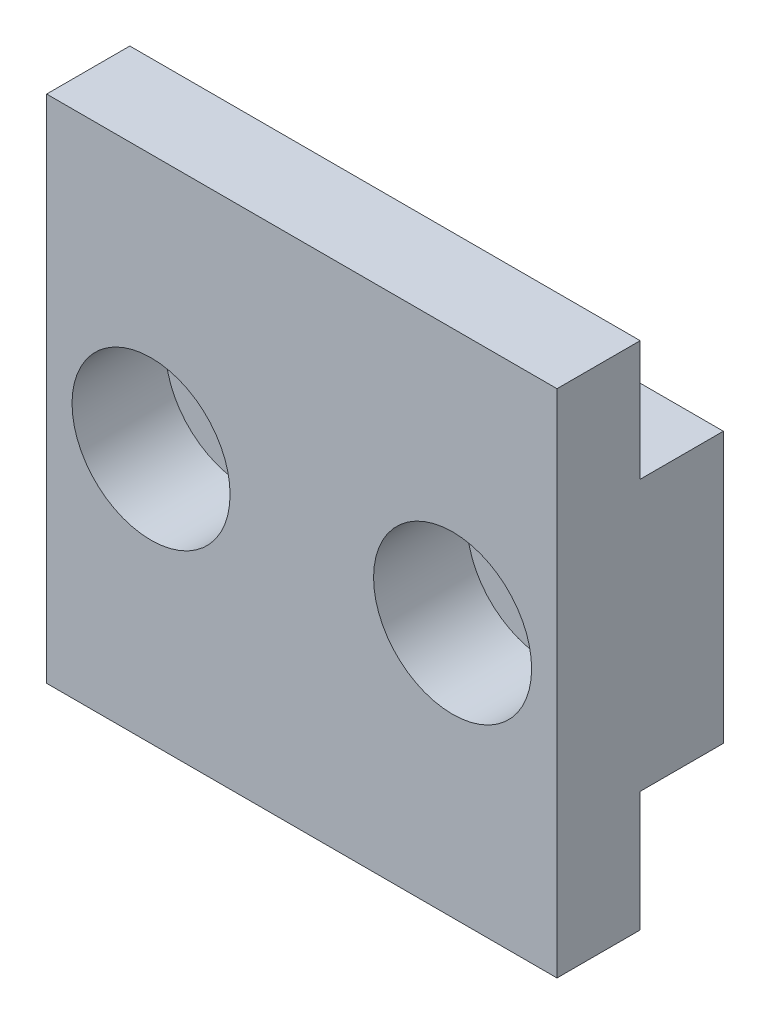
ISO-10303-21;
HEADER;
FILE_DESCRIPTION(('STEP AP214'),'2;1');
FILE_NAME('part.step','',(''),(''),'','','');
FILE_SCHEMA(('AUTOMOTIVE_DESIGN { 1 0 10303 214 1 1 1 1 }'));
ENDSEC;
DATA;
#1=APPLICATION_CONTEXT('core data for automotive mechanical design processes');
#2=APPLICATION_PROTOCOL_DEFINITION('international standard','automotive_design',2000,#1);
#3=PRODUCT_CONTEXT('',#1,'mechanical');
#4=PRODUCT('Part','Part','',(#3));
#5=PRODUCT_RELATED_PRODUCT_CATEGORY('part','',(#4));
#6=PRODUCT_DEFINITION_FORMATION('','',#4);
#7=PRODUCT_DEFINITION_CONTEXT('part definition',#1,'design');
#8=PRODUCT_DEFINITION('design','',#6,#7);
#9=PRODUCT_DEFINITION_SHAPE('','',#8);
#10=(LENGTH_UNIT() NAMED_UNIT(*) SI_UNIT(.MILLI.,.METRE.));
#11=(NAMED_UNIT(*) PLANE_ANGLE_UNIT() SI_UNIT($,.RADIAN.));
#12=(NAMED_UNIT(*) SI_UNIT($,.STERADIAN.) SOLID_ANGLE_UNIT());
#13=UNCERTAINTY_MEASURE_WITH_UNIT(LENGTH_MEASURE(1.E-05),#10,'distance_accuracy_value','');
#14=(GEOMETRIC_REPRESENTATION_CONTEXT(3) GLOBAL_UNCERTAINTY_ASSIGNED_CONTEXT((#13)) GLOBAL_UNIT_ASSIGNED_CONTEXT((#10,
#11,#12)) REPRESENTATION_CONTEXT('',''));
#15=CARTESIAN_POINT('',(0.,0.,0.));
#16=DIRECTION('',(0.,0.,1.));
#17=DIRECTION('',(1.,0.,0.));
#18=AXIS2_PLACEMENT_3D('',#15,#16,#17);
#19=CARTESIAN_POINT('',(74.979,6.5,8.));
#20=DIRECTION('',(0.,0.,-1.));
#21=DIRECTION('',(-1.,0.,0.));
#22=AXIS2_PLACEMENT_3D('',#19,#20,#21);
#23=CYLINDRICAL_SURFACE('',#22,2.29999999999999);
#24=CARTESIAN_POINT('',(74.979,6.5,0.));
#25=DIRECTION('',(0.,0.,-1.));
#26=DIRECTION('',(-1.,0.,0.));
#27=AXIS2_PLACEMENT_3D('',#24,#25,#26);
#28=CIRCLE('',#27,2.29999999999999);
#29=CARTESIAN_POINT('',(72.679,6.5,0.));
#30=VERTEX_POINT('',#29);
#31=EDGE_CURVE('E156',#30,#30,#28,.T.);
#32=ORIENTED_EDGE('',*,*,#31,.T.);
#33=EDGE_LOOP('',(#32));
#34=FACE_BOUND('',#33,.T.);
#35=CARTESIAN_POINT('',(74.979,6.5,3.5));
#36=DIRECTION('',(0.,0.,1.));
#37=DIRECTION('',(1.,0.,0.));
#38=AXIS2_PLACEMENT_3D('',#35,#36,#37);
#39=CIRCLE('',#38,2.29999999999999);
#40=CARTESIAN_POINT('',(77.279,6.5,3.5));
#41=VERTEX_POINT('',#40);
#42=EDGE_CURVE('E37',#41,#41,#39,.F.);
#43=ORIENTED_EDGE('',*,*,#42,.F.);
#44=EDGE_LOOP('',(#43));
#45=FACE_BOUND('',#44,.T.);
#46=ADVANCED_FACE('F33',(#34,#45),#23,.F.);
#47=CARTESIAN_POINT('',(60.479,6.5,8.));
#48=DIRECTION('',(0.,0.,-1.));
#49=DIRECTION('',(-1.,0.,0.));
#50=AXIS2_PLACEMENT_3D('',#47,#48,#49);
#51=CYLINDRICAL_SURFACE('',#50,2.3);
#52=CARTESIAN_POINT('',(60.479,6.5,0.));
#53=DIRECTION('',(0.,0.,-1.));
#54=DIRECTION('',(-1.,0.,0.));
#55=AXIS2_PLACEMENT_3D('',#52,#53,#54);
#56=CIRCLE('',#55,2.3);
#57=CARTESIAN_POINT('',(58.179,6.5,0.));
#58=VERTEX_POINT('',#57);
#59=EDGE_CURVE('E171',#58,#58,#56,.T.);
#60=ORIENTED_EDGE('',*,*,#59,.T.);
#61=EDGE_LOOP('',(#60));
#62=FACE_BOUND('',#61,.T.);
#63=CARTESIAN_POINT('',(60.479,6.5,3.5));
#64=DIRECTION('',(0.,0.,1.));
#65=DIRECTION('',(1.,0.,0.));
#66=AXIS2_PLACEMENT_3D('',#63,#64,#65);
#67=CIRCLE('',#66,2.3);
#68=CARTESIAN_POINT('',(62.779,6.5,3.5));
#69=VERTEX_POINT('',#68);
#70=EDGE_CURVE('E150',#69,#69,#67,.F.);
#71=ORIENTED_EDGE('',*,*,#70,.F.);
#72=EDGE_LOOP('',(#71));
#73=FACE_BOUND('',#72,.T.);
#74=ADVANCED_FACE('F216',(#62,#73),#51,.F.);
#75=CARTESIAN_POINT('',(80.,0.,4.));
#76=DIRECTION('',(-1.,0.,0.));
#77=DIRECTION('',(0.,0.,1.));
#78=AXIS2_PLACEMENT_3D('',#75,#76,#77);
#79=PLANE('',#78);
#80=DIRECTION('',(0.,1.,0.));
#81=VECTOR('',#80,1.);
#82=CARTESIAN_POINT('',(80.,0.,0.));
#83=LINE('',#82,#81);
#84=CARTESIAN_POINT('',(80.,0.,0.));
#85=VERTEX_POINT('',#84);
#86=CARTESIAN_POINT('',(80.,13.,0.));
#87=VERTEX_POINT('',#86);
#88=EDGE_CURVE('E131',#85,#87,#83,.T.);
#89=ORIENTED_EDGE('',*,*,#88,.T.);
#90=DIRECTION('',(0.,0.,-1.));
#91=VECTOR('',#90,1.);
#92=CARTESIAN_POINT('',(80.,13.,4.));
#93=LINE('',#92,#91);
#94=CARTESIAN_POINT('',(80.,13.,4.));
#95=VERTEX_POINT('',#94);
#96=EDGE_CURVE('E11',#95,#87,#93,.T.);
#97=ORIENTED_EDGE('',*,*,#96,.F.);
#98=DIRECTION('',(0.,1.,0.));
#99=VECTOR('',#98,1.);
#100=CARTESIAN_POINT('',(80.,18.771,4.));
#101=LINE('',#100,#99);
#102=CARTESIAN_POINT('',(80.,18.771,4.));
#103=VERTEX_POINT('',#102);
#104=EDGE_CURVE('E184',#95,#103,#101,.T.);
#105=ORIENTED_EDGE('',*,*,#104,.T.);
#106=DIRECTION('',(0.,0.,-1.));
#107=VECTOR('',#106,1.);
#108=CARTESIAN_POINT('',(80.,18.771,8.));
#109=LINE('',#108,#107);
#110=CARTESIAN_POINT('',(80.,18.771,8.));
#111=VERTEX_POINT('',#110);
#112=EDGE_CURVE('E136',#111,#103,#109,.T.);
#113=ORIENTED_EDGE('',*,*,#112,.F.);
#114=DIRECTION('',(0.,1.,0.));
#115=VECTOR('',#114,1.);
#116=CARTESIAN_POINT('',(80.,18.771,8.));
#117=LINE('',#116,#115);
#118=CARTESIAN_POINT('',(80.,-5.771,8.));
#119=VERTEX_POINT('',#118);
#120=EDGE_CURVE('E116',#119,#111,#117,.T.);
#121=ORIENTED_EDGE('',*,*,#120,.F.);
#122=DIRECTION('',(0.,0.,-1.));
#123=VECTOR('',#122,1.);
#124=CARTESIAN_POINT('',(80.,-5.771,8.));
#125=LINE('',#124,#123);
#126=CARTESIAN_POINT('',(80.,-5.771,4.));
#127=VERTEX_POINT('',#126);
#128=EDGE_CURVE('E113',#119,#127,#125,.T.);
#129=ORIENTED_EDGE('',*,*,#128,.T.);
#130=CARTESIAN_POINT('',(80.,0.,4.));
#131=VERTEX_POINT('',#130);
#132=EDGE_CURVE('E185',#127,#131,#101,.T.);
#133=ORIENTED_EDGE('',*,*,#132,.T.);
#134=DIRECTION('',(0.,0.,-1.));
#135=VECTOR('',#134,1.);
#136=CARTESIAN_POINT('',(80.,0.,4.));
#137=LINE('',#136,#135);
#138=EDGE_CURVE('E143',#131,#85,#137,.T.);
#139=ORIENTED_EDGE('',*,*,#138,.T.);
#140=EDGE_LOOP('',(#89,#97,#105,#113,#121,#129,#133,#139));
#141=FACE_BOUND('',#140,.T.);
#142=ADVANCED_FACE('F35',(#141),#79,.F.);
#143=CARTESIAN_POINT('',(80.,13.,4.));
#144=DIRECTION('',(0.,-1.,0.));
#145=DIRECTION('',(1.,0.,0.));
#146=AXIS2_PLACEMENT_3D('',#143,#144,#145);
#147=PLANE('',#146);
#148=DIRECTION('',(-1.,0.,0.));
#149=VECTOR('',#148,1.);
#150=CARTESIAN_POINT('',(80.,13.,0.));
#151=LINE('',#150,#149);
#152=CARTESIAN_POINT('',(55.458,13.,0.));
#153=VERTEX_POINT('',#152);
#154=EDGE_CURVE('E134',#87,#153,#151,.T.);
#155=ORIENTED_EDGE('',*,*,#154,.T.);
#156=DIRECTION('',(0.,0.,-1.));
#157=VECTOR('',#156,1.);
#158=CARTESIAN_POINT('',(55.458,13.,4.));
#159=LINE('',#158,#157);
#160=CARTESIAN_POINT('',(55.458,13.,4.));
#161=VERTEX_POINT('',#160);
#162=EDGE_CURVE('E43',#161,#153,#159,.T.);
#163=ORIENTED_EDGE('',*,*,#162,.F.);
#164=DIRECTION('',(-1.,0.,0.));
#165=VECTOR('',#164,1.);
#166=CARTESIAN_POINT('',(80.,13.,4.));
#167=LINE('',#166,#165);
#168=EDGE_CURVE('E78',#95,#161,#167,.T.);
#169=ORIENTED_EDGE('',*,*,#168,.F.);
#170=ORIENTED_EDGE('',*,*,#96,.T.);
#171=EDGE_LOOP('',(#155,#163,#169,#170));
#172=FACE_BOUND('',#171,.T.);
#173=ADVANCED_FACE('F316',(#172),#147,.F.);
#174=CARTESIAN_POINT('',(55.458,0.,4.));
#175=DIRECTION('',(1.,0.,0.));
#176=DIRECTION('',(0.,0.,-1.));
#177=AXIS2_PLACEMENT_3D('',#174,#175,#176);
#178=PLANE('',#177);
#179=DIRECTION('',(0.,-1.,0.));
#180=VECTOR('',#179,1.);
#181=CARTESIAN_POINT('',(55.458,0.,0.));
#182=LINE('',#181,#180);
#183=CARTESIAN_POINT('',(55.458,0.,0.));
#184=VERTEX_POINT('',#183);
#185=EDGE_CURVE('E68',#153,#184,#182,.T.);
#186=ORIENTED_EDGE('',*,*,#185,.T.);
#187=DIRECTION('',(0.,0.,-1.));
#188=VECTOR('',#187,1.);
#189=CARTESIAN_POINT('',(55.458,0.,4.));
#190=LINE('',#189,#188);
#191=CARTESIAN_POINT('',(55.458,0.,4.));
#192=VERTEX_POINT('',#191);
#193=EDGE_CURVE('E52',#192,#184,#190,.T.);
#194=ORIENTED_EDGE('',*,*,#193,.F.);
#195=DIRECTION('',(0.,-1.,0.));
#196=VECTOR('',#195,1.);
#197=CARTESIAN_POINT('',(55.458,18.771,4.));
#198=LINE('',#197,#196);
#199=CARTESIAN_POINT('',(55.458,-5.771,4.));
#200=VERTEX_POINT('',#199);
#201=EDGE_CURVE('E129',#192,#200,#198,.T.);
#202=ORIENTED_EDGE('',*,*,#201,.T.);
#203=DIRECTION('',(0.,0.,-1.));
#204=VECTOR('',#203,1.);
#205=CARTESIAN_POINT('',(55.458,-5.771,8.));
#206=LINE('',#205,#204);
#207=CARTESIAN_POINT('',(55.458,-5.771,8.));
#208=VERTEX_POINT('',#207);
#209=EDGE_CURVE('E111',#208,#200,#206,.T.);
#210=ORIENTED_EDGE('',*,*,#209,.F.);
#211=DIRECTION('',(0.,-1.,0.));
#212=VECTOR('',#211,1.);
#213=CARTESIAN_POINT('',(55.458,18.771,8.));
#214=LINE('',#213,#212);
#215=CARTESIAN_POINT('',(55.458,18.771,8.));
#216=VERTEX_POINT('',#215);
#217=EDGE_CURVE('E117',#216,#208,#214,.T.);
#218=ORIENTED_EDGE('',*,*,#217,.F.);
#219=DIRECTION('',(0.,0.,-1.));
#220=VECTOR('',#219,1.);
#221=CARTESIAN_POINT('',(55.458,18.771,8.));
#222=LINE('',#221,#220);
#223=CARTESIAN_POINT('',(55.458,18.771,4.));
#224=VERTEX_POINT('',#223);
#225=EDGE_CURVE('E178',#216,#224,#222,.T.);
#226=ORIENTED_EDGE('',*,*,#225,.T.);
#227=EDGE_CURVE('E179',#224,#161,#198,.T.);
#228=ORIENTED_EDGE('',*,*,#227,.T.);
#229=ORIENTED_EDGE('',*,*,#162,.T.);
#230=EDGE_LOOP('',(#186,#194,#202,#210,#218,#226,#228,#229));
#231=FACE_BOUND('',#230,.T.);
#232=ADVANCED_FACE('F127',(#231),#178,.F.);
#233=CARTESIAN_POINT('',(80.,0.,4.));
#234=DIRECTION('',(0.,1.,0.));
#235=DIRECTION('',(-1.,0.,0.));
#236=AXIS2_PLACEMENT_3D('',#233,#234,#235);
#237=PLANE('',#236);
#238=DIRECTION('',(1.,0.,0.));
#239=VECTOR('',#238,1.);
#240=CARTESIAN_POINT('',(80.,0.,0.));
#241=LINE('',#240,#239);
#242=EDGE_CURVE('E73',#184,#85,#241,.T.);
#243=ORIENTED_EDGE('',*,*,#242,.T.);
#244=ORIENTED_EDGE('',*,*,#138,.F.);
#245=DIRECTION('',(1.,0.,0.));
#246=VECTOR('',#245,1.);
#247=CARTESIAN_POINT('',(80.,0.,4.));
#248=LINE('',#247,#246);
#249=EDGE_CURVE('E141',#192,#131,#248,.T.);
#250=ORIENTED_EDGE('',*,*,#249,.F.);
#251=ORIENTED_EDGE('',*,*,#193,.T.);
#252=EDGE_LOOP('',(#243,#244,#250,#251));
#253=FACE_BOUND('',#252,.T.);
#254=ADVANCED_FACE('F203',(#253),#237,.F.);
#255=CARTESIAN_POINT('',(0.,0.,0.));
#256=DIRECTION('',(0.,0.,1.));
#257=DIRECTION('',(1.,0.,0.));
#258=AXIS2_PLACEMENT_3D('',#255,#256,#257);
#259=PLANE('',#258);
#260=ORIENTED_EDGE('',*,*,#59,.F.);
#261=EDGE_LOOP('',(#260));
#262=FACE_BOUND('',#261,.T.);
#263=ORIENTED_EDGE('',*,*,#31,.F.);
#264=EDGE_LOOP('',(#263));
#265=FACE_BOUND('',#264,.T.);
#266=ORIENTED_EDGE('',*,*,#88,.F.);
#267=ORIENTED_EDGE('',*,*,#242,.F.);
#268=ORIENTED_EDGE('',*,*,#185,.F.);
#269=ORIENTED_EDGE('',*,*,#154,.F.);
#270=EDGE_LOOP('',(#266,#267,#268,#269));
#271=FACE_BOUND('',#270,.T.);
#272=ADVANCED_FACE('F201',(#262,#265,#271),#259,.F.);
#273=CARTESIAN_POINT('',(0.,0.,4.));
#274=DIRECTION('',(0.,0.,1.));
#275=DIRECTION('',(1.,0.,0.));
#276=AXIS2_PLACEMENT_3D('',#273,#274,#275);
#277=PLANE('',#276);
#278=ORIENTED_EDGE('',*,*,#104,.F.);
#279=ORIENTED_EDGE('',*,*,#168,.T.);
#280=ORIENTED_EDGE('',*,*,#227,.F.);
#281=DIRECTION('',(-1.,0.,0.));
#282=VECTOR('',#281,1.);
#283=CARTESIAN_POINT('',(55.458,18.771,4.));
#284=LINE('',#283,#282);
#285=EDGE_CURVE('E125',#103,#224,#284,.T.);
#286=ORIENTED_EDGE('',*,*,#285,.F.);
#287=EDGE_LOOP('',(#278,#279,#280,#286));
#288=FACE_BOUND('',#287,.T.);
#289=ADVANCED_FACE('F198',(#288),#277,.F.);
#290=ORIENTED_EDGE('',*,*,#201,.F.);
#291=ORIENTED_EDGE('',*,*,#249,.T.);
#292=ORIENTED_EDGE('',*,*,#132,.F.);
#293=DIRECTION('',(1.,0.,0.));
#294=VECTOR('',#293,1.);
#295=CARTESIAN_POINT('',(55.458,-5.771,4.));
#296=LINE('',#295,#294);
#297=EDGE_CURVE('E182',#200,#127,#296,.T.);
#298=ORIENTED_EDGE('',*,*,#297,.F.);
#299=EDGE_LOOP('',(#290,#291,#292,#298));
#300=FACE_BOUND('',#299,.T.);
#301=ADVANCED_FACE('F205',(#300),#277,.F.);
#302=CARTESIAN_POINT('',(55.458,-5.771,8.));
#303=DIRECTION('',(0.,1.,0.));
#304=DIRECTION('',(-1.,0.,0.));
#305=AXIS2_PLACEMENT_3D('',#302,#303,#304);
#306=PLANE('',#305);
#307=ORIENTED_EDGE('',*,*,#297,.T.);
#308=ORIENTED_EDGE('',*,*,#128,.F.);
#309=DIRECTION('',(1.,0.,0.));
#310=VECTOR('',#309,1.);
#311=CARTESIAN_POINT('',(55.458,-5.771,8.));
#312=LINE('',#311,#310);
#313=EDGE_CURVE('E107',#208,#119,#312,.T.);
#314=ORIENTED_EDGE('',*,*,#313,.F.);
#315=ORIENTED_EDGE('',*,*,#209,.T.);
#316=EDGE_LOOP('',(#307,#308,#314,#315));
#317=FACE_BOUND('',#316,.T.);
#318=ADVANCED_FACE('F109',(#317),#306,.F.);
#319=CARTESIAN_POINT('',(55.458,18.771,8.));
#320=DIRECTION('',(0.,-1.,0.));
#321=DIRECTION('',(1.,0.,0.));
#322=AXIS2_PLACEMENT_3D('',#319,#320,#321);
#323=PLANE('',#322);
#324=ORIENTED_EDGE('',*,*,#285,.T.);
#325=ORIENTED_EDGE('',*,*,#225,.F.);
#326=DIRECTION('',(-1.,0.,0.));
#327=VECTOR('',#326,1.);
#328=CARTESIAN_POINT('',(55.458,18.771,8.));
#329=LINE('',#328,#327);
#330=EDGE_CURVE('E122',#111,#216,#329,.T.);
#331=ORIENTED_EDGE('',*,*,#330,.F.);
#332=ORIENTED_EDGE('',*,*,#112,.T.);
#333=EDGE_LOOP('',(#324,#325,#331,#332));
#334=FACE_BOUND('',#333,.T.);
#335=ADVANCED_FACE('F193',(#334),#323,.F.);
#336=CARTESIAN_POINT('',(0.,0.,8.));
#337=DIRECTION('',(0.,0.,1.));
#338=DIRECTION('',(1.,0.,0.));
#339=AXIS2_PLACEMENT_3D('',#336,#337,#338);
#340=PLANE('',#339);
#341=CARTESIAN_POINT('',(60.479,6.5,8.));
#342=DIRECTION('',(0.,0.,1.));
#343=DIRECTION('',(1.,0.,0.));
#344=AXIS2_PLACEMENT_3D('',#341,#342,#343);
#345=CIRCLE('',#344,3.8);
#346=CARTESIAN_POINT('',(64.279,6.5,8.));
#347=VERTEX_POINT('',#346);
#348=EDGE_CURVE('E158',#347,#347,#345,.T.);
#349=ORIENTED_EDGE('',*,*,#348,.F.);
#350=EDGE_LOOP('',(#349));
#351=FACE_BOUND('',#350,.T.);
#352=CARTESIAN_POINT('',(74.979,6.5,8.));
#353=DIRECTION('',(0.,0.,1.));
#354=DIRECTION('',(1.,0.,0.));
#355=AXIS2_PLACEMENT_3D('',#352,#353,#354);
#356=CIRCLE('',#355,3.8);
#357=CARTESIAN_POINT('',(78.779,6.5,8.));
#358=VERTEX_POINT('',#357);
#359=EDGE_CURVE('E168',#358,#358,#356,.T.);
#360=ORIENTED_EDGE('',*,*,#359,.F.);
#361=EDGE_LOOP('',(#360));
#362=FACE_BOUND('',#361,.T.);
#363=ORIENTED_EDGE('',*,*,#217,.T.);
#364=ORIENTED_EDGE('',*,*,#313,.T.);
#365=ORIENTED_EDGE('',*,*,#120,.T.);
#366=ORIENTED_EDGE('',*,*,#330,.T.);
#367=EDGE_LOOP('',(#363,#364,#365,#366));
#368=FACE_BOUND('',#367,.T.);
#369=ADVANCED_FACE('F120',(#351,#362,#368),#340,.T.);
#370=CARTESIAN_POINT('',(60.479,6.5,3.5));
#371=DIRECTION('',(0.,0.,1.));
#372=DIRECTION('',(1.,0.,0.));
#373=AXIS2_PLACEMENT_3D('',#370,#371,#372);
#374=PLANE('',#373);
#375=CARTESIAN_POINT('',(60.479,6.5,3.5));
#376=DIRECTION('',(0.,0.,1.));
#377=DIRECTION('',(1.,0.,0.));
#378=AXIS2_PLACEMENT_3D('',#375,#376,#377);
#379=CIRCLE('',#378,3.8);
#380=CARTESIAN_POINT('',(64.279,6.5,3.5));
#381=VERTEX_POINT('',#380);
#382=EDGE_CURVE('E152',#381,#381,#379,.T.);
#383=ORIENTED_EDGE('',*,*,#382,.T.);
#384=EDGE_LOOP('',(#383));
#385=FACE_BOUND('',#384,.T.);
#386=ORIENTED_EDGE('',*,*,#70,.T.);
#387=EDGE_LOOP('',(#386));
#388=FACE_BOUND('',#387,.T.);
#389=ADVANCED_FACE('F227',(#385,#388),#374,.T.);
#390=CARTESIAN_POINT('',(60.479,6.5,3.5));
#391=DIRECTION('',(0.,0.,1.));
#392=DIRECTION('',(1.,0.,0.));
#393=AXIS2_PLACEMENT_3D('',#390,#391,#392);
#394=CYLINDRICAL_SURFACE('',#393,3.8);
#395=ORIENTED_EDGE('',*,*,#382,.F.);
#396=EDGE_LOOP('',(#395));
#397=FACE_BOUND('',#396,.T.);
#398=ORIENTED_EDGE('',*,*,#348,.T.);
#399=EDGE_LOOP('',(#398));
#400=FACE_BOUND('',#399,.T.);
#401=ADVANCED_FACE('F233',(#397,#400),#394,.F.);
#402=CARTESIAN_POINT('',(74.979,6.5,3.5));
#403=DIRECTION('',(0.,0.,1.));
#404=DIRECTION('',(1.,0.,0.));
#405=AXIS2_PLACEMENT_3D('',#402,#403,#404);
#406=PLANE('',#405);
#407=CARTESIAN_POINT('',(74.979,6.5,3.5));
#408=DIRECTION('',(0.,0.,1.));
#409=DIRECTION('',(1.,0.,0.));
#410=AXIS2_PLACEMENT_3D('',#407,#408,#409);
#411=CIRCLE('',#410,3.8);
#412=CARTESIAN_POINT('',(78.779,6.5,3.5));
#413=VERTEX_POINT('',#412);
#414=EDGE_CURVE('E163',#413,#413,#411,.T.);
#415=ORIENTED_EDGE('',*,*,#414,.T.);
#416=EDGE_LOOP('',(#415));
#417=FACE_BOUND('',#416,.T.);
#418=ORIENTED_EDGE('',*,*,#42,.T.);
#419=EDGE_LOOP('',(#418));
#420=FACE_BOUND('',#419,.T.);
#421=ADVANCED_FACE('F241',(#417,#420),#406,.T.);
#422=CARTESIAN_POINT('',(74.979,6.5,3.5));
#423=DIRECTION('',(0.,0.,1.));
#424=DIRECTION('',(1.,0.,0.));
#425=AXIS2_PLACEMENT_3D('',#422,#423,#424);
#426=CYLINDRICAL_SURFACE('',#425,3.8);
#427=ORIENTED_EDGE('',*,*,#414,.F.);
#428=EDGE_LOOP('',(#427));
#429=FACE_BOUND('',#428,.T.);
#430=ORIENTED_EDGE('',*,*,#359,.T.);
#431=EDGE_LOOP('',(#430));
#432=FACE_BOUND('',#431,.T.);
#433=ADVANCED_FACE('F239',(#429,#432),#426,.F.);
#434=CLOSED_SHELL('',(#46,#74,#142,#173,#232,#254,#272,#289,#301,#318,#335,#369,#389,#401,#421,#433));
#435=MANIFOLD_SOLID_BREP('B2',#434);
#436=ADVANCED_BREP_SHAPE_REPRESENTATION('',(#18,#435),#14);
#437=SHAPE_DEFINITION_REPRESENTATION(#9,#436);
ENDSEC;
END-ISO-10303-21;
